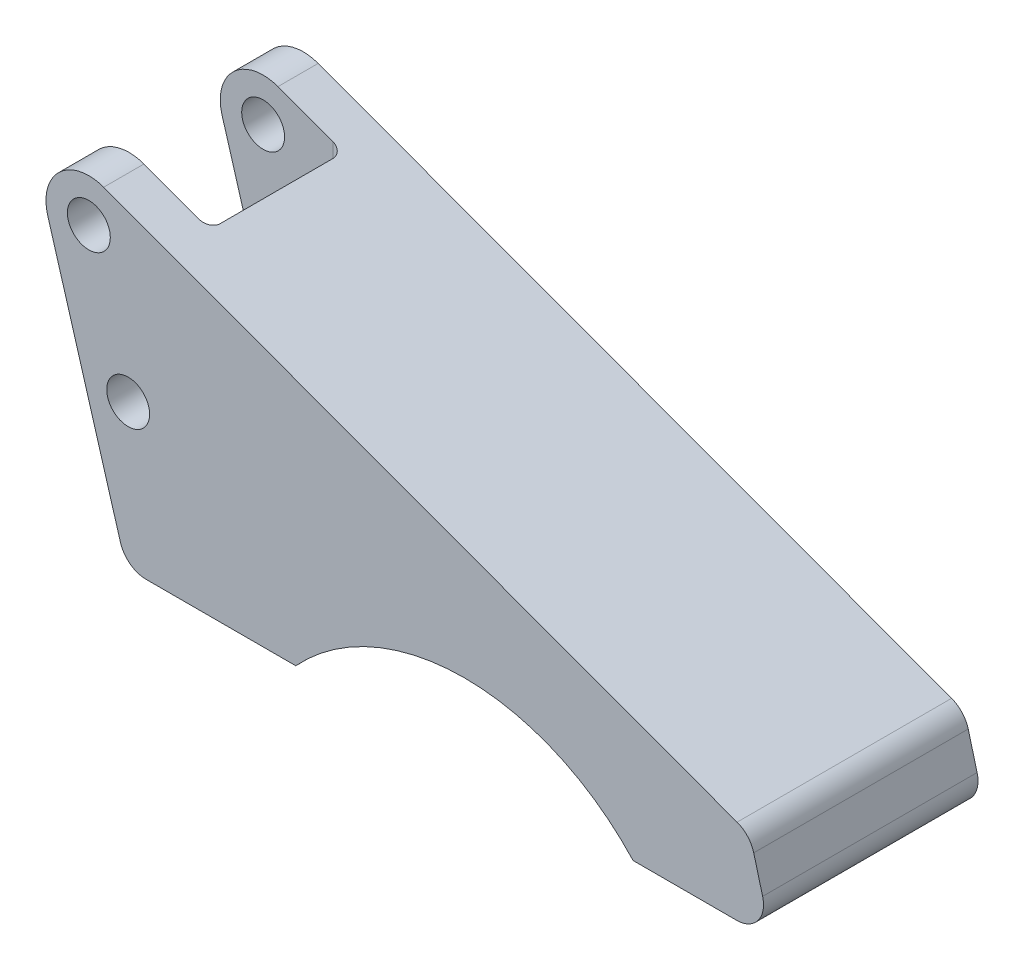
ISO-10303-21;
HEADER;
FILE_DESCRIPTION(('STEP AP214'),'2;1');
FILE_NAME('part.step','',(''),(''),'','','');
FILE_SCHEMA(('AUTOMOTIVE_DESIGN { 1 0 10303 214 1 1 1 1 }'));
ENDSEC;
DATA;
#1=APPLICATION_CONTEXT('core data for automotive mechanical design processes');
#2=APPLICATION_PROTOCOL_DEFINITION('international standard','automotive_design',2000,#1);
#3=PRODUCT_CONTEXT('',#1,'mechanical');
#4=PRODUCT('Part','Part','',(#3));
#5=PRODUCT_RELATED_PRODUCT_CATEGORY('part','',(#4));
#6=PRODUCT_DEFINITION_FORMATION('','',#4);
#7=PRODUCT_DEFINITION_CONTEXT('part definition',#1,'design');
#8=PRODUCT_DEFINITION('design','',#6,#7);
#9=PRODUCT_DEFINITION_SHAPE('','',#8);
#10=(LENGTH_UNIT() NAMED_UNIT(*) SI_UNIT(.MILLI.,.METRE.));
#11=(NAMED_UNIT(*) PLANE_ANGLE_UNIT() SI_UNIT($,.RADIAN.));
#12=(NAMED_UNIT(*) SI_UNIT($,.STERADIAN.) SOLID_ANGLE_UNIT());
#13=UNCERTAINTY_MEASURE_WITH_UNIT(LENGTH_MEASURE(1.E-05),#10,'distance_accuracy_value','');
#14=(GEOMETRIC_REPRESENTATION_CONTEXT(3) GLOBAL_UNCERTAINTY_ASSIGNED_CONTEXT((#13)) GLOBAL_UNIT_ASSIGNED_CONTEXT((#10,
#11,#12)) REPRESENTATION_CONTEXT('',''));
#15=CARTESIAN_POINT('',(0.,0.,0.));
#16=DIRECTION('',(0.,0.,1.));
#17=DIRECTION('',(1.,0.,0.));
#18=AXIS2_PLACEMENT_3D('',#15,#16,#17);
#19=CARTESIAN_POINT('',(6.94754617431199,-51.87,-40.));
#20=DIRECTION('',(-0.959205668272246,-0.282709189723987,0.));
#21=DIRECTION('',(0.282709189723987,-0.959205668272246,0.));
#22=AXIS2_PLACEMENT_3D('',#19,#20,#21);
#23=PLANE('',#22);
#24=DIRECTION('',(0.282709189723987,-0.959205668272246,0.));
#25=VECTOR('',#24,1.);
#26=CARTESIAN_POINT('',(6.94754617431199,-51.87,-32.5));
#27=LINE('',#26,#25);
#28=CARTESIAN_POINT('',(-7.67364534617797,-2.2616735177919,-32.5));
#29=VERTEX_POINT('',#28);
#30=CARTESIAN_POINT('',(5.8905012126467,-48.2835459486199,-32.5));
#31=VERTEX_POINT('',#30);
#32=EDGE_CURVE('E169',#29,#31,#27,.T.);
#33=ORIENTED_EDGE('',*,*,#32,.F.);
#34=DIRECTION('',(0.,0.,1.));
#35=VECTOR('',#34,1.);
#36=CARTESIAN_POINT('',(-7.67364534617797,-2.2616735177919,-40.));
#37=LINE('',#36,#35);
#38=CARTESIAN_POINT('',(-7.67364534617797,-2.2616735177919,-40.));
#39=VERTEX_POINT('',#38);
#40=EDGE_CURVE('E223',#39,#29,#37,.T.);
#41=ORIENTED_EDGE('',*,*,#40,.F.);
#42=DIRECTION('',(0.282709189723987,-0.959205668272246,0.));
#43=VECTOR('',#42,1.);
#44=CARTESIAN_POINT('',(6.94754617431199,-51.87,-40.));
#45=LINE('',#44,#43);
#46=CARTESIAN_POINT('',(5.8905012126467,-48.2835459486199,-40.));
#47=VERTEX_POINT('',#46);
#48=EDGE_CURVE('E238',#39,#47,#45,.T.);
#49=ORIENTED_EDGE('',*,*,#48,.T.);
#50=DIRECTION('',(0.,0.,1.));
#51=VECTOR('',#50,1.);
#52=CARTESIAN_POINT('',(5.8905012126467,-48.2835459486199,-40.));
#53=LINE('',#52,#51);
#54=EDGE_CURVE('E180',#47,#31,#53,.T.);
#55=ORIENTED_EDGE('',*,*,#54,.T.);
#56=EDGE_LOOP('',(#33,#41,#49,#55));
#57=FACE_BOUND('',#56,.T.);
#58=ADVANCED_FACE('F33',(#57),#23,.T.);
#59=CARTESIAN_POINT('',(0.,0.,-40.));
#60=DIRECTION('',(0.,0.,1.));
#61=DIRECTION('',(1.,0.,0.));
#62=AXIS2_PLACEMENT_3D('',#59,#60,#61);
#63=CYLINDRICAL_SURFACE('',#62,8.);
#64=CARTESIAN_POINT('',(0.,0.,-7.5));
#65=DIRECTION('',(0.,0.,1.));
#66=DIRECTION('',(1.,0.,0.));
#67=AXIS2_PLACEMENT_3D('',#64,#65,#66);
#68=CIRCLE('',#67,8.);
#69=CARTESIAN_POINT('',(-7.67364534617797,-2.2616735177919,-7.5));
#70=VERTEX_POINT('',#69);
#71=CARTESIAN_POINT('',(2.76335629071986,7.50758696323518,-7.5));
#72=VERTEX_POINT('',#71);
#73=EDGE_CURVE('E339',#70,#72,#68,.F.);
#74=ORIENTED_EDGE('',*,*,#73,.F.);
#75=CARTESIAN_POINT('',(-7.67364534617797,-2.2616735177919,0.));
#76=VERTEX_POINT('',#75);
#77=EDGE_CURVE('E227',#70,#76,#37,.T.);
#78=ORIENTED_EDGE('',*,*,#77,.T.);
#79=CARTESIAN_POINT('',(0.,0.,0.));
#80=DIRECTION('',(0.,0.,1.));
#81=DIRECTION('',(1.,0.,0.));
#82=AXIS2_PLACEMENT_3D('',#79,#80,#81);
#83=CIRCLE('',#82,8.);
#84=CARTESIAN_POINT('',(2.76335629071986,7.50758696323518,0.));
#85=VERTEX_POINT('',#84);
#86=EDGE_CURVE('E281',#85,#76,#83,.T.);
#87=ORIENTED_EDGE('',*,*,#86,.F.);
#88=DIRECTION('',(0.,0.,1.));
#89=VECTOR('',#88,1.);
#90=CARTESIAN_POINT('',(2.76335629071986,7.50758696323518,-40.));
#91=LINE('',#90,#89);
#92=EDGE_CURVE('E228',#72,#85,#91,.T.);
#93=ORIENTED_EDGE('',*,*,#92,.F.);
#94=EDGE_LOOP('',(#74,#78,#87,#93));
#95=FACE_BOUND('',#94,.T.);
#96=ADVANCED_FACE('F355',(#95),#63,.T.);
#97=CARTESIAN_POINT('',(0.,0.,-40.));
#98=DIRECTION('',(0.,0.,1.));
#99=DIRECTION('',(1.,0.,0.));
#100=AXIS2_PLACEMENT_3D('',#97,#98,#99);
#101=CYLINDRICAL_SURFACE('',#100,4.);
#102=CARTESIAN_POINT('',(0.,0.,-32.5));
#103=DIRECTION('',(0.,0.,-1.));
#104=DIRECTION('',(-1.,0.,0.));
#105=AXIS2_PLACEMENT_3D('',#102,#103,#104);
#106=CIRCLE('',#105,4.);
#107=CARTESIAN_POINT('',(-4.,0.,-32.5));
#108=VERTEX_POINT('',#107);
#109=EDGE_CURVE('E322',#108,#108,#106,.F.);
#110=ORIENTED_EDGE('',*,*,#109,.T.);
#111=EDGE_LOOP('',(#110));
#112=FACE_BOUND('',#111,.T.);
#113=CARTESIAN_POINT('',(0.,0.,-40.));
#114=DIRECTION('',(0.,0.,1.));
#115=DIRECTION('',(1.,0.,0.));
#116=AXIS2_PLACEMENT_3D('',#113,#114,#115);
#117=CIRCLE('',#116,4.);
#118=CARTESIAN_POINT('',(4.,0.,-40.));
#119=VERTEX_POINT('',#118);
#120=EDGE_CURVE('E299',#119,#119,#117,.T.);
#121=ORIENTED_EDGE('',*,*,#120,.F.);
#122=EDGE_LOOP('',(#121));
#123=FACE_BOUND('',#122,.T.);
#124=ADVANCED_FACE('F388',(#112,#123),#101,.F.);
#125=CARTESIAN_POINT('',(7.33,-24.87,-40.));
#126=DIRECTION('',(0.,0.,1.));
#127=DIRECTION('',(1.,0.,0.));
#128=AXIS2_PLACEMENT_3D('',#125,#126,#127);
#129=CYLINDRICAL_SURFACE('',#128,4.);
#130=CARTESIAN_POINT('',(7.33,-24.87,-32.5));
#131=DIRECTION('',(0.,0.,-1.));
#132=DIRECTION('',(-1.,0.,0.));
#133=AXIS2_PLACEMENT_3D('',#130,#131,#132);
#134=CIRCLE('',#133,4.);
#135=CARTESIAN_POINT('',(3.33,-24.87,-32.5));
#136=VERTEX_POINT('',#135);
#137=EDGE_CURVE('E214',#136,#136,#134,.F.);
#138=ORIENTED_EDGE('',*,*,#137,.T.);
#139=EDGE_LOOP('',(#138));
#140=FACE_BOUND('',#139,.T.);
#141=CARTESIAN_POINT('',(7.33,-24.87,-40.));
#142=DIRECTION('',(0.,0.,1.));
#143=DIRECTION('',(1.,0.,0.));
#144=AXIS2_PLACEMENT_3D('',#141,#142,#143);
#145=CIRCLE('',#144,4.);
#146=CARTESIAN_POINT('',(11.33,-24.87,-40.));
#147=VERTEX_POINT('',#146);
#148=EDGE_CURVE('E316',#147,#147,#145,.T.);
#149=ORIENTED_EDGE('',*,*,#148,.F.);
#150=EDGE_LOOP('',(#149));
#151=FACE_BOUND('',#150,.T.);
#152=ADVANCED_FACE('F402',(#140,#151),#129,.F.);
#153=CARTESIAN_POINT('',(10.6865295540079,-46.87,-40.));
#154=DIRECTION('',(0.,0.,1.));
#155=DIRECTION('',(1.,0.,0.));
#156=AXIS2_PLACEMENT_3D('',#153,#154,#155);
#157=CYLINDRICAL_SURFACE('',#156,5.);
#158=CARTESIAN_POINT('',(10.6865295540079,-46.87,-32.5));
#159=DIRECTION('',(0.,0.,-1.));
#160=DIRECTION('',(-1.,0.,0.));
#161=AXIS2_PLACEMENT_3D('',#158,#159,#160);
#162=CIRCLE('',#161,5.);
#163=CARTESIAN_POINT('',(10.6865295540079,-51.87,-32.5));
#164=VERTEX_POINT('',#163);
#165=EDGE_CURVE('E165',#31,#164,#162,.F.);
#166=ORIENTED_EDGE('',*,*,#165,.F.);
#167=ORIENTED_EDGE('',*,*,#54,.F.);
#168=CARTESIAN_POINT('',(10.6865295540079,-46.87,-40.));
#169=DIRECTION('',(0.,0.,1.));
#170=DIRECTION('',(1.,0.,0.));
#171=AXIS2_PLACEMENT_3D('',#168,#169,#170);
#172=CIRCLE('',#171,5.);
#173=CARTESIAN_POINT('',(10.6865295540079,-51.87,-40.));
#174=VERTEX_POINT('',#173);
#175=EDGE_CURVE('E178',#174,#47,#172,.F.);
#176=ORIENTED_EDGE('',*,*,#175,.F.);
#177=DIRECTION('',(0.,0.,1.));
#178=VECTOR('',#177,1.);
#179=CARTESIAN_POINT('',(10.6865295540079,-51.87,-40.));
#180=LINE('',#179,#178);
#181=EDGE_CURVE('E158',#164,#174,#180,.F.);
#182=ORIENTED_EDGE('',*,*,#181,.F.);
#183=EDGE_LOOP('',(#166,#167,#176,#182));
#184=FACE_BOUND('',#183,.T.);
#185=ADVANCED_FACE('F177',(#184),#157,.T.);
#186=CARTESIAN_POINT('',(38.5852070424871,-51.87,-40.));
#187=DIRECTION('',(0.,-1.,0.));
#188=DIRECTION('',(1.,0.,0.));
#189=AXIS2_PLACEMENT_3D('',#186,#187,#188);
#190=PLANE('',#189);
#191=DIRECTION('',(0.,0.,-1.));
#192=VECTOR('',#191,1.);
#193=CARTESIAN_POINT('',(15.,-51.87,-32.5));
#194=LINE('',#193,#192);
#195=CARTESIAN_POINT('',(15.,-51.87,-9.5));
#196=VERTEX_POINT('',#195);
#197=CARTESIAN_POINT('',(15.,-51.87,-30.5));
#198=VERTEX_POINT('',#197);
#199=EDGE_CURVE('E162',#196,#198,#194,.T.);
#200=ORIENTED_EDGE('',*,*,#199,.T.);
#201=CARTESIAN_POINT('',(13.,-51.87,-30.5));
#202=DIRECTION('',(0.,-1.,0.));
#203=DIRECTION('',(1.,0.,0.));
#204=AXIS2_PLACEMENT_3D('',#201,#202,#203);
#205=CIRCLE('',#204,2.);
#206=CARTESIAN_POINT('',(13.,-51.87,-32.5));
#207=VERTEX_POINT('',#206);
#208=EDGE_CURVE('E11',#198,#207,#205,.F.);
#209=ORIENTED_EDGE('',*,*,#208,.T.);
#210=DIRECTION('',(-1.,0.,0.));
#211=VECTOR('',#210,1.);
#212=CARTESIAN_POINT('',(-10.,-51.87,-32.5));
#213=LINE('',#212,#211);
#214=EDGE_CURVE('E154',#207,#164,#213,.T.);
#215=ORIENTED_EDGE('',*,*,#214,.T.);
#216=ORIENTED_EDGE('',*,*,#181,.T.);
#217=DIRECTION('',(1.,0.,0.));
#218=VECTOR('',#217,1.);
#219=CARTESIAN_POINT('',(38.5852070424871,-51.87,-40.));
#220=LINE('',#219,#218);
#221=CARTESIAN_POINT('',(38.5852070424871,-51.87,-40.));
#222=VERTEX_POINT('',#221);
#223=EDGE_CURVE('E282',#174,#222,#220,.T.);
#224=ORIENTED_EDGE('',*,*,#223,.T.);
#225=DIRECTION('',(0.,0.,1.));
#226=VECTOR('',#225,1.);
#227=CARTESIAN_POINT('',(38.5852070424871,-51.87,-40.));
#228=LINE('',#227,#226);
#229=CARTESIAN_POINT('',(38.5852070424871,-51.87,0.));
#230=VERTEX_POINT('',#229);
#231=EDGE_CURVE('E235',#222,#230,#228,.T.);
#232=ORIENTED_EDGE('',*,*,#231,.T.);
#233=DIRECTION('',(1.,0.,0.));
#234=VECTOR('',#233,1.);
#235=CARTESIAN_POINT('',(38.5852070424871,-51.87,0.));
#236=LINE('',#235,#234);
#237=CARTESIAN_POINT('',(10.6865295540079,-51.87,0.));
#238=VERTEX_POINT('',#237);
#239=EDGE_CURVE('E297',#238,#230,#236,.T.);
#240=ORIENTED_EDGE('',*,*,#239,.F.);
#241=CARTESIAN_POINT('',(10.6865295540079,-51.87,-7.5));
#242=VERTEX_POINT('',#241);
#243=EDGE_CURVE('E179',#238,#242,#180,.F.);
#244=ORIENTED_EDGE('',*,*,#243,.T.);
#245=DIRECTION('',(1.,0.,0.));
#246=VECTOR('',#245,1.);
#247=CARTESIAN_POINT('',(-10.,-51.87,-7.5));
#248=LINE('',#247,#246);
#249=CARTESIAN_POINT('',(13.,-51.87,-7.5));
#250=VERTEX_POINT('',#249);
#251=EDGE_CURVE('E343',#242,#250,#248,.T.);
#252=ORIENTED_EDGE('',*,*,#251,.T.);
#253=CARTESIAN_POINT('',(13.,-51.87,-9.5));
#254=DIRECTION('',(0.,-1.,0.));
#255=DIRECTION('',(1.,0.,0.));
#256=AXIS2_PLACEMENT_3D('',#253,#254,#255);
#257=CIRCLE('',#256,2.);
#258=EDGE_CURVE('E201',#250,#196,#257,.F.);
#259=ORIENTED_EDGE('',*,*,#258,.T.);
#260=EDGE_LOOP('',(#200,#209,#215,#216,#224,#232,#240,#244,#252,#259));
#261=FACE_BOUND('',#260,.T.);
#262=ADVANCED_FACE('F156',(#261),#190,.T.);
#263=DIRECTION('',(-0.282709189723987,0.959205668272246,0.));
#264=VECTOR('',#263,1.);
#265=CARTESIAN_POINT('',(6.94754617431199,-51.87,-7.5));
#266=LINE('',#265,#264);
#267=CARTESIAN_POINT('',(5.8905012126467,-48.2835459486199,-7.5));
#268=VERTEX_POINT('',#267);
#269=EDGE_CURVE('E161',#268,#70,#266,.T.);
#270=ORIENTED_EDGE('',*,*,#269,.F.);
#271=CARTESIAN_POINT('',(5.8905012126467,-48.2835459486199,0.));
#272=VERTEX_POINT('',#271);
#273=EDGE_CURVE('E183',#268,#272,#53,.T.);
#274=ORIENTED_EDGE('',*,*,#273,.T.);
#275=DIRECTION('',(0.282709189723987,-0.959205668272246,0.));
#276=VECTOR('',#275,1.);
#277=CARTESIAN_POINT('',(6.94754617431199,-51.87,0.));
#278=LINE('',#277,#276);
#279=EDGE_CURVE('E268',#76,#272,#278,.T.);
#280=ORIENTED_EDGE('',*,*,#279,.F.);
#281=ORIENTED_EDGE('',*,*,#77,.F.);
#282=EDGE_LOOP('',(#270,#274,#280,#281));
#283=FACE_BOUND('',#282,.T.);
#284=ADVANCED_FACE('F265',(#283),#23,.T.);
#285=ORIENTED_EDGE('',*,*,#40,.T.);
#286=CARTESIAN_POINT('',(0.,0.,-32.5));
#287=DIRECTION('',(0.,0.,-1.));
#288=DIRECTION('',(-1.,0.,0.));
#289=AXIS2_PLACEMENT_3D('',#286,#287,#288);
#290=CIRCLE('',#289,8.);
#291=CARTESIAN_POINT('',(2.76335629071986,7.50758696323518,-32.5));
#292=VERTEX_POINT('',#291);
#293=EDGE_CURVE('E213',#292,#29,#290,.F.);
#294=ORIENTED_EDGE('',*,*,#293,.F.);
#295=CARTESIAN_POINT('',(2.76335629071986,7.50758696323518,-40.));
#296=VERTEX_POINT('',#295);
#297=EDGE_CURVE('E221',#296,#292,#91,.T.);
#298=ORIENTED_EDGE('',*,*,#297,.F.);
#299=CARTESIAN_POINT('',(0.,0.,-40.));
#300=DIRECTION('',(0.,0.,1.));
#301=DIRECTION('',(1.,0.,0.));
#302=AXIS2_PLACEMENT_3D('',#299,#300,#301);
#303=CIRCLE('',#302,8.);
#304=EDGE_CURVE('E302',#296,#39,#303,.T.);
#305=ORIENTED_EDGE('',*,*,#304,.T.);
#306=EDGE_LOOP('',(#285,#294,#298,#305));
#307=FACE_BOUND('',#306,.T.);
#308=ADVANCED_FACE('F219',(#307),#63,.T.);
#309=CARTESIAN_POINT('',(123.33,-36.87,-40.));
#310=DIRECTION('',(0.345419536339983,0.938448370404398,0.));
#311=DIRECTION('',(-0.938448370404398,0.345419536339983,0.));
#312=AXIS2_PLACEMENT_3D('',#309,#310,#311);
#313=PLANE('',#312);
#314=DIRECTION('',(-0.938448370404398,0.345419536339983,0.));
#315=VECTOR('',#314,1.);
#316=CARTESIAN_POINT('',(123.33,-36.87,-32.5));
#317=LINE('',#316,#315);
#318=CARTESIAN_POINT('',(13.,3.73973266751784,-32.5));
#319=VERTEX_POINT('',#318);
#320=EDGE_CURVE('E207',#319,#292,#317,.T.);
#321=ORIENTED_EDGE('',*,*,#320,.F.);
#322=CARTESIAN_POINT('',(13.,3.73973266751784,-30.5));
#323=DIRECTION('',(0.345419536339983,0.938448370404398,0.));
#324=DIRECTION('',(0.938448370404398,-0.345419536339983,0.));
#325=AXIS2_PLACEMENT_3D('',#322,#323,#324);
#326=ELLIPSE('',#325,2.13117744467728,2.);
#327=CARTESIAN_POINT('',(15.,3.00358234271918,-30.5));
#328=VERTEX_POINT('',#327);
#329=EDGE_CURVE('E41',#319,#328,#326,.F.);
#330=ORIENTED_EDGE('',*,*,#329,.T.);
#331=DIRECTION('',(0.,0.,-1.));
#332=VECTOR('',#331,1.);
#333=CARTESIAN_POINT('',(15.,3.00358234271918,-40.));
#334=LINE('',#333,#332);
#335=CARTESIAN_POINT('',(15.,3.00358234271918,-9.5));
#336=VERTEX_POINT('',#335);
#337=EDGE_CURVE('E173',#336,#328,#334,.T.);
#338=ORIENTED_EDGE('',*,*,#337,.F.);
#339=CARTESIAN_POINT('',(13.,3.73973266751784,-9.5));
#340=DIRECTION('',(0.345419536339983,0.938448370404398,0.));
#341=DIRECTION('',(0.938448370404398,-0.345419536339983,0.));
#342=AXIS2_PLACEMENT_3D('',#339,#340,#341);
#343=ELLIPSE('',#342,2.13117744467728,2.);
#344=CARTESIAN_POINT('',(13.,3.73973266751784,-7.5));
#345=VERTEX_POINT('',#344);
#346=EDGE_CURVE('E199',#336,#345,#343,.F.);
#347=ORIENTED_EDGE('',*,*,#346,.T.);
#348=DIRECTION('',(0.938448370404398,-0.345419536339983,0.));
#349=VECTOR('',#348,1.);
#350=CARTESIAN_POINT('',(123.33,-36.87,-7.5));
#351=LINE('',#350,#349);
#352=EDGE_CURVE('E336',#72,#345,#351,.T.);
#353=ORIENTED_EDGE('',*,*,#352,.F.);
#354=ORIENTED_EDGE('',*,*,#92,.T.);
#355=DIRECTION('',(-0.938448370404398,0.345419536339983,0.));
#356=VECTOR('',#355,1.);
#357=CARTESIAN_POINT('',(123.33,-36.87,0.));
#358=LINE('',#357,#356);
#359=CARTESIAN_POINT('',(120.894593949471,-35.9735875224431,0.));
#360=VERTEX_POINT('',#359);
#361=EDGE_CURVE('E285',#360,#85,#358,.T.);
#362=ORIENTED_EDGE('',*,*,#361,.F.);
#363=DIRECTION('',(0.,0.,1.));
#364=VECTOR('',#363,1.);
#365=CARTESIAN_POINT('',(120.894593949471,-35.9735875224431,-40.));
#366=LINE('',#365,#364);
#367=CARTESIAN_POINT('',(120.894593949471,-35.9735875224431,-40.));
#368=VERTEX_POINT('',#367);
#369=EDGE_CURVE('E257',#360,#368,#366,.F.);
#370=ORIENTED_EDGE('',*,*,#369,.T.);
#371=DIRECTION('',(-0.938448370404398,0.345419536339983,0.));
#372=VECTOR('',#371,1.);
#373=CARTESIAN_POINT('',(123.33,-36.87,-40.));
#374=LINE('',#373,#372);
#375=EDGE_CURVE('E226',#368,#296,#374,.T.);
#376=ORIENTED_EDGE('',*,*,#375,.T.);
#377=ORIENTED_EDGE('',*,*,#297,.T.);
#378=EDGE_LOOP('',(#321,#330,#338,#347,#353,#354,#362,#370,#376,#377));
#379=FACE_BOUND('',#378,.T.);
#380=ADVANCED_FACE('F205',(#379),#313,.T.);
#381=CARTESIAN_POINT('',(127.33,-51.87,-40.));
#382=DIRECTION('',(0.966234939601247,0.257662650560332,0.));
#383=DIRECTION('',(-0.257662650560332,0.966234939601247,0.));
#384=AXIS2_PLACEMENT_3D('',#381,#382,#383);
#385=PLANE('',#384);
#386=DIRECTION('',(-0.257662650560332,0.966234939601246,0.));
#387=VECTOR('',#386,1.);
#388=CARTESIAN_POINT('',(127.33,-51.87,0.));
#389=LINE('',#388,#387);
#390=CARTESIAN_POINT('',(125.65311646592,-45.5816867471983,0.));
#391=VERTEX_POINT('',#390);
#392=CARTESIAN_POINT('',(123.998670965777,-39.3775161216634,0.));
#393=VERTEX_POINT('',#392);
#394=EDGE_CURVE('E289',#391,#393,#389,.T.);
#395=ORIENTED_EDGE('',*,*,#394,.F.);
#396=DIRECTION('',(0.,0.,1.));
#397=VECTOR('',#396,1.);
#398=CARTESIAN_POINT('',(125.65311646592,-45.5816867471983,-40.));
#399=LINE('',#398,#397);
#400=CARTESIAN_POINT('',(125.65311646592,-45.5816867471983,-40.));
#401=VERTEX_POINT('',#400);
#402=EDGE_CURVE('E251',#391,#401,#399,.F.);
#403=ORIENTED_EDGE('',*,*,#402,.T.);
#404=DIRECTION('',(-0.257662650560332,0.966234939601246,0.));
#405=VECTOR('',#404,1.);
#406=CARTESIAN_POINT('',(127.33,-51.87,-40.));
#407=LINE('',#406,#405);
#408=CARTESIAN_POINT('',(123.998670965777,-39.3775161216634,-40.));
#409=VERTEX_POINT('',#408);
#410=EDGE_CURVE('E305',#401,#409,#407,.T.);
#411=ORIENTED_EDGE('',*,*,#410,.T.);
#412=DIRECTION('',(0.,0.,1.));
#413=VECTOR('',#412,1.);
#414=CARTESIAN_POINT('',(123.998670965777,-39.3775161216634,-40.));
#415=LINE('',#414,#413);
#416=EDGE_CURVE('E248',#409,#393,#415,.T.);
#417=ORIENTED_EDGE('',*,*,#416,.T.);
#418=EDGE_LOOP('',(#395,#403,#411,#417));
#419=FACE_BOUND('',#418,.T.);
#420=ADVANCED_FACE('F362',(#419),#385,.T.);
#421=CARTESIAN_POINT('',(101.494792957513,-51.87,-40.));
#422=DIRECTION('',(0.,-1.,0.));
#423=DIRECTION('',(1.,0.,0.));
#424=AXIS2_PLACEMENT_3D('',#421,#422,#423);
#425=PLANE('',#424);
#426=DIRECTION('',(1.,0.,0.));
#427=VECTOR('',#426,1.);
#428=CARTESIAN_POINT('',(101.494792957513,-51.87,-40.));
#429=LINE('',#428,#427);
#430=CARTESIAN_POINT('',(101.494792957513,-51.87,-40.));
#431=VERTEX_POINT('',#430);
#432=CARTESIAN_POINT('',(120.821941767913,-51.87,-40.));
#433=VERTEX_POINT('',#432);
#434=EDGE_CURVE('E308',#431,#433,#429,.T.);
#435=ORIENTED_EDGE('',*,*,#434,.T.);
#436=DIRECTION('',(0.,0.,1.));
#437=VECTOR('',#436,1.);
#438=CARTESIAN_POINT('',(120.821941767913,-51.87,-40.));
#439=LINE('',#438,#437);
#440=CARTESIAN_POINT('',(120.821941767913,-51.87,0.));
#441=VERTEX_POINT('',#440);
#442=EDGE_CURVE('E239',#433,#441,#439,.T.);
#443=ORIENTED_EDGE('',*,*,#442,.T.);
#444=DIRECTION('',(1.,0.,0.));
#445=VECTOR('',#444,1.);
#446=CARTESIAN_POINT('',(101.494792957513,-51.87,0.));
#447=LINE('',#446,#445);
#448=CARTESIAN_POINT('',(101.494792957513,-51.87,0.));
#449=VERTEX_POINT('',#448);
#450=EDGE_CURVE('E292',#449,#441,#447,.T.);
#451=ORIENTED_EDGE('',*,*,#450,.F.);
#452=DIRECTION('',(0.,0.,1.));
#453=VECTOR('',#452,1.);
#454=CARTESIAN_POINT('',(101.494792957513,-51.87,-40.));
#455=LINE('',#454,#453);
#456=EDGE_CURVE('E231',#431,#449,#455,.T.);
#457=ORIENTED_EDGE('',*,*,#456,.F.);
#458=EDGE_LOOP('',(#435,#443,#451,#457));
#459=FACE_BOUND('',#458,.T.);
#460=ADVANCED_FACE('F374',(#459),#425,.T.);
#461=CARTESIAN_POINT('',(70.04,-80.88,-40.));
#462=DIRECTION('',(0.,0.,1.));
#463=DIRECTION('',(1.,0.,0.));
#464=AXIS2_PLACEMENT_3D('',#461,#462,#463);
#465=CYLINDRICAL_SURFACE('',#464,42.79);
#466=CARTESIAN_POINT('',(70.04,-80.88,0.));
#467=DIRECTION('',(0.,0.,-1.));
#468=DIRECTION('',(1.,0.,0.));
#469=AXIS2_PLACEMENT_3D('',#466,#467,#468);
#470=CIRCLE('',#469,42.79);
#471=EDGE_CURVE('E294',#230,#449,#470,.T.);
#472=ORIENTED_EDGE('',*,*,#471,.F.);
#473=ORIENTED_EDGE('',*,*,#231,.F.);
#474=CARTESIAN_POINT('',(70.04,-80.88,-40.));
#475=DIRECTION('',(0.,0.,-1.));
#476=DIRECTION('',(1.,0.,0.));
#477=AXIS2_PLACEMENT_3D('',#474,#475,#476);
#478=CIRCLE('',#477,42.79);
#479=EDGE_CURVE('E283',#222,#431,#478,.T.);
#480=ORIENTED_EDGE('',*,*,#479,.T.);
#481=ORIENTED_EDGE('',*,*,#456,.T.);
#482=EDGE_LOOP('',(#472,#473,#480,#481));
#483=FACE_BOUND('',#482,.T.);
#484=ADVANCED_FACE('F378',(#483),#465,.F.);
#485=CARTESIAN_POINT('',(0.,0.,-40.));
#486=DIRECTION('',(0.,0.,1.));
#487=DIRECTION('',(1.,0.,0.));
#488=AXIS2_PLACEMENT_3D('',#485,#486,#487);
#489=PLANE('',#488);
#490=ORIENTED_EDGE('',*,*,#148,.T.);
#491=EDGE_LOOP('',(#490));
#492=FACE_BOUND('',#491,.T.);
#493=ORIENTED_EDGE('',*,*,#120,.T.);
#494=EDGE_LOOP('',(#493));
#495=FACE_BOUND('',#494,.T.);
#496=ORIENTED_EDGE('',*,*,#410,.F.);
#497=CARTESIAN_POINT('',(120.821941767913,-46.87,-40.));
#498=DIRECTION('',(0.,0.,1.));
#499=DIRECTION('',(1.,0.,0.));
#500=AXIS2_PLACEMENT_3D('',#497,#498,#499);
#501=CIRCLE('',#500,5.);
#502=EDGE_CURVE('E256',#401,#433,#501,.F.);
#503=ORIENTED_EDGE('',*,*,#502,.T.);
#504=ORIENTED_EDGE('',*,*,#434,.F.);
#505=ORIENTED_EDGE('',*,*,#479,.F.);
#506=ORIENTED_EDGE('',*,*,#223,.F.);
#507=ORIENTED_EDGE('',*,*,#175,.T.);
#508=ORIENTED_EDGE('',*,*,#48,.F.);
#509=ORIENTED_EDGE('',*,*,#304,.F.);
#510=ORIENTED_EDGE('',*,*,#375,.F.);
#511=CARTESIAN_POINT('',(119.167496267771,-40.6658293744651,-40.));
#512=DIRECTION('',(0.,0.,1.));
#513=DIRECTION('',(1.,0.,0.));
#514=AXIS2_PLACEMENT_3D('',#511,#512,#513);
#515=CIRCLE('',#514,5.);
#516=EDGE_CURVE('E254',#368,#409,#515,.F.);
#517=ORIENTED_EDGE('',*,*,#516,.T.);
#518=EDGE_LOOP('',(#496,#503,#504,#505,#506,#507,#508,#509,#510,#517));
#519=FACE_BOUND('',#518,.T.);
#520=ADVANCED_FACE('F367',(#492,#495,#519),#489,.F.);
#521=CARTESIAN_POINT('',(0.,0.,0.));
#522=DIRECTION('',(0.,0.,1.));
#523=DIRECTION('',(1.,0.,0.));
#524=AXIS2_PLACEMENT_3D('',#521,#522,#523);
#525=PLANE('',#524);
#526=CARTESIAN_POINT('',(7.33,-24.87,0.));
#527=DIRECTION('',(0.,0.,1.));
#528=DIRECTION('',(1.,0.,0.));
#529=AXIS2_PLACEMENT_3D('',#526,#527,#528);
#530=CIRCLE('',#529,4.);
#531=CARTESIAN_POINT('',(11.33,-24.87,0.));
#532=VERTEX_POINT('',#531);
#533=EDGE_CURVE('E319',#532,#532,#530,.T.);
#534=ORIENTED_EDGE('',*,*,#533,.F.);
#535=EDGE_LOOP('',(#534));
#536=FACE_BOUND('',#535,.T.);
#537=CARTESIAN_POINT('',(0.,0.,0.));
#538=DIRECTION('',(0.,0.,1.));
#539=DIRECTION('',(1.,0.,0.));
#540=AXIS2_PLACEMENT_3D('',#537,#538,#539);
#541=CIRCLE('',#540,4.);
#542=CARTESIAN_POINT('',(4.,0.,0.));
#543=VERTEX_POINT('',#542);
#544=EDGE_CURVE('E313',#543,#543,#541,.T.);
#545=ORIENTED_EDGE('',*,*,#544,.F.);
#546=EDGE_LOOP('',(#545));
#547=FACE_BOUND('',#546,.T.);
#548=ORIENTED_EDGE('',*,*,#450,.T.);
#549=CARTESIAN_POINT('',(120.821941767913,-46.87,0.));
#550=DIRECTION('',(0.,0.,1.));
#551=DIRECTION('',(1.,0.,0.));
#552=AXIS2_PLACEMENT_3D('',#549,#550,#551);
#553=CIRCLE('',#552,5.);
#554=EDGE_CURVE('E246',#441,#391,#553,.T.);
#555=ORIENTED_EDGE('',*,*,#554,.T.);
#556=ORIENTED_EDGE('',*,*,#394,.T.);
#557=CARTESIAN_POINT('',(119.167496267771,-40.6658293744651,0.));
#558=DIRECTION('',(0.,0.,1.));
#559=DIRECTION('',(1.,0.,0.));
#560=AXIS2_PLACEMENT_3D('',#557,#558,#559);
#561=CIRCLE('',#560,5.);
#562=EDGE_CURVE('E244',#393,#360,#561,.T.);
#563=ORIENTED_EDGE('',*,*,#562,.T.);
#564=ORIENTED_EDGE('',*,*,#361,.T.);
#565=ORIENTED_EDGE('',*,*,#86,.T.);
#566=ORIENTED_EDGE('',*,*,#279,.T.);
#567=CARTESIAN_POINT('',(10.6865295540079,-46.87,0.));
#568=DIRECTION('',(0.,0.,1.));
#569=DIRECTION('',(1.,0.,0.));
#570=AXIS2_PLACEMENT_3D('',#567,#568,#569);
#571=CIRCLE('',#570,5.);
#572=EDGE_CURVE('E242',#272,#238,#571,.T.);
#573=ORIENTED_EDGE('',*,*,#572,.T.);
#574=ORIENTED_EDGE('',*,*,#239,.T.);
#575=ORIENTED_EDGE('',*,*,#471,.T.);
#576=EDGE_LOOP('',(#548,#555,#556,#563,#564,#565,#566,#573,#574,#575));
#577=FACE_BOUND('',#576,.T.);
#578=ADVANCED_FACE('F278',(#536,#547,#577),#525,.T.);
#579=CARTESIAN_POINT('',(0.,0.,-7.5));
#580=DIRECTION('',(0.,0.,1.));
#581=DIRECTION('',(1.,0.,0.));
#582=AXIS2_PLACEMENT_3D('',#579,#580,#581);
#583=CIRCLE('',#582,4.);
#584=CARTESIAN_POINT('',(4.,0.,-7.5));
#585=VERTEX_POINT('',#584);
#586=EDGE_CURVE('E330',#585,#585,#583,.F.);
#587=ORIENTED_EDGE('',*,*,#586,.T.);
#588=EDGE_LOOP('',(#587));
#589=FACE_BOUND('',#588,.T.);
#590=ORIENTED_EDGE('',*,*,#544,.T.);
#591=EDGE_LOOP('',(#590));
#592=FACE_BOUND('',#591,.T.);
#593=ADVANCED_FACE('F426',(#589,#592),#101,.F.);
#594=CARTESIAN_POINT('',(7.33,-24.87,-7.5));
#595=DIRECTION('',(0.,0.,1.));
#596=DIRECTION('',(1.,0.,0.));
#597=AXIS2_PLACEMENT_3D('',#594,#595,#596);
#598=CIRCLE('',#597,4.);
#599=CARTESIAN_POINT('',(11.33,-24.87,-7.5));
#600=VERTEX_POINT('',#599);
#601=EDGE_CURVE('E333',#600,#600,#598,.F.);
#602=ORIENTED_EDGE('',*,*,#601,.T.);
#603=EDGE_LOOP('',(#602));
#604=FACE_BOUND('',#603,.T.);
#605=ORIENTED_EDGE('',*,*,#533,.T.);
#606=EDGE_LOOP('',(#605));
#607=FACE_BOUND('',#606,.T.);
#608=ADVANCED_FACE('F409',(#604,#607),#129,.F.);
#609=CARTESIAN_POINT('',(120.821941767913,-46.87,-40.));
#610=DIRECTION('',(0.,0.,1.));
#611=DIRECTION('',(1.,0.,0.));
#612=AXIS2_PLACEMENT_3D('',#609,#610,#611);
#613=CYLINDRICAL_SURFACE('',#612,5.);
#614=ORIENTED_EDGE('',*,*,#502,.F.);
#615=ORIENTED_EDGE('',*,*,#402,.F.);
#616=ORIENTED_EDGE('',*,*,#554,.F.);
#617=ORIENTED_EDGE('',*,*,#442,.F.);
#618=EDGE_LOOP('',(#614,#615,#616,#617));
#619=FACE_BOUND('',#618,.T.);
#620=ADVANCED_FACE('F371',(#619),#613,.T.);
#621=CARTESIAN_POINT('',(119.167496267771,-40.6658293744651,-40.));
#622=DIRECTION('',(0.,0.,1.));
#623=DIRECTION('',(1.,0.,0.));
#624=AXIS2_PLACEMENT_3D('',#621,#622,#623);
#625=CYLINDRICAL_SURFACE('',#624,5.);
#626=ORIENTED_EDGE('',*,*,#516,.F.);
#627=ORIENTED_EDGE('',*,*,#369,.F.);
#628=ORIENTED_EDGE('',*,*,#562,.F.);
#629=ORIENTED_EDGE('',*,*,#416,.F.);
#630=EDGE_LOOP('',(#626,#627,#628,#629));
#631=FACE_BOUND('',#630,.T.);
#632=ADVANCED_FACE('F360',(#631),#625,.T.);
#633=CARTESIAN_POINT('',(10.6865295540079,-46.87,-7.5));
#634=DIRECTION('',(0.,0.,1.));
#635=DIRECTION('',(1.,0.,0.));
#636=AXIS2_PLACEMENT_3D('',#633,#634,#635);
#637=CIRCLE('',#636,5.);
#638=EDGE_CURVE('E174',#242,#268,#637,.F.);
#639=ORIENTED_EDGE('',*,*,#638,.F.);
#640=ORIENTED_EDGE('',*,*,#243,.F.);
#641=ORIENTED_EDGE('',*,*,#572,.F.);
#642=ORIENTED_EDGE('',*,*,#273,.F.);
#643=EDGE_LOOP('',(#639,#640,#641,#642));
#644=FACE_BOUND('',#643,.T.);
#645=ADVANCED_FACE('F273',(#644),#157,.T.);
#646=CARTESIAN_POINT('',(-10.,-51.87,-32.5));
#647=DIRECTION('',(0.,0.,-1.));
#648=DIRECTION('',(-1.,0.,0.));
#649=AXIS2_PLACEMENT_3D('',#646,#647,#648);
#650=PLANE('',#649);
#651=ORIENTED_EDGE('',*,*,#137,.F.);
#652=EDGE_LOOP('',(#651));
#653=FACE_BOUND('',#652,.T.);
#654=ORIENTED_EDGE('',*,*,#214,.F.);
#655=DIRECTION('',(0.,1.,0.));
#656=VECTOR('',#655,1.);
#657=CARTESIAN_POINT('',(13.,3.00358234271918,-32.5));
#658=LINE('',#657,#656);
#659=EDGE_CURVE('E197',#207,#319,#658,.T.);
#660=ORIENTED_EDGE('',*,*,#659,.T.);
#661=ORIENTED_EDGE('',*,*,#320,.T.);
#662=ORIENTED_EDGE('',*,*,#293,.T.);
#663=ORIENTED_EDGE('',*,*,#32,.T.);
#664=ORIENTED_EDGE('',*,*,#165,.T.);
#665=EDGE_LOOP('',(#654,#660,#661,#662,#663,#664));
#666=FACE_BOUND('',#665,.T.);
#667=ORIENTED_EDGE('',*,*,#109,.F.);
#668=EDGE_LOOP('',(#667));
#669=FACE_BOUND('',#668,.T.);
#670=ADVANCED_FACE('F166',(#653,#666,#669),#650,.F.);
#671=CARTESIAN_POINT('',(-10.,-51.87,-7.5));
#672=DIRECTION('',(0.,0.,1.));
#673=DIRECTION('',(1.,0.,0.));
#674=AXIS2_PLACEMENT_3D('',#671,#672,#673);
#675=PLANE('',#674);
#676=ORIENTED_EDGE('',*,*,#601,.F.);
#677=EDGE_LOOP('',(#676));
#678=FACE_BOUND('',#677,.T.);
#679=ORIENTED_EDGE('',*,*,#352,.T.);
#680=DIRECTION('',(0.,1.,0.));
#681=VECTOR('',#680,1.);
#682=CARTESIAN_POINT('',(13.,-51.87,-7.5));
#683=LINE('',#682,#681);
#684=EDGE_CURVE('E195',#345,#250,#683,.F.);
#685=ORIENTED_EDGE('',*,*,#684,.T.);
#686=ORIENTED_EDGE('',*,*,#251,.F.);
#687=ORIENTED_EDGE('',*,*,#638,.T.);
#688=ORIENTED_EDGE('',*,*,#269,.T.);
#689=ORIENTED_EDGE('',*,*,#73,.T.);
#690=EDGE_LOOP('',(#679,#685,#686,#687,#688,#689));
#691=FACE_BOUND('',#690,.T.);
#692=ORIENTED_EDGE('',*,*,#586,.F.);
#693=EDGE_LOOP('',(#692));
#694=FACE_BOUND('',#693,.T.);
#695=ADVANCED_FACE('F352',(#678,#691,#694),#675,.F.);
#696=CARTESIAN_POINT('',(15.,-51.87,-32.5));
#697=DIRECTION('',(1.,0.,0.));
#698=DIRECTION('',(0.,0.,-1.));
#699=AXIS2_PLACEMENT_3D('',#696,#697,#698);
#700=PLANE('',#699);
#701=ORIENTED_EDGE('',*,*,#199,.F.);
#702=DIRECTION('',(0.,1.,0.));
#703=VECTOR('',#702,1.);
#704=CARTESIAN_POINT('',(15.,3.00358234271918,-9.5));
#705=LINE('',#704,#703);
#706=EDGE_CURVE('E192',#196,#336,#705,.T.);
#707=ORIENTED_EDGE('',*,*,#706,.T.);
#708=ORIENTED_EDGE('',*,*,#337,.T.);
#709=DIRECTION('',(0.,1.,0.));
#710=VECTOR('',#709,1.);
#711=CARTESIAN_POINT('',(15.,-51.87,-30.5));
#712=LINE('',#711,#710);
#713=EDGE_CURVE('E190',#328,#198,#712,.F.);
#714=ORIENTED_EDGE('',*,*,#713,.T.);
#715=EDGE_LOOP('',(#701,#707,#708,#714));
#716=FACE_BOUND('',#715,.T.);
#717=ADVANCED_FACE('F210',(#716),#700,.F.);
#718=CARTESIAN_POINT('',(13.,-51.87,-9.5));
#719=DIRECTION('',(0.,-1.,0.));
#720=DIRECTION('',(0.,0.,-1.));
#721=AXIS2_PLACEMENT_3D('',#718,#719,#720);
#722=CYLINDRICAL_SURFACE('',#721,2.);
#723=ORIENTED_EDGE('',*,*,#258,.F.);
#724=ORIENTED_EDGE('',*,*,#684,.F.);
#725=ORIENTED_EDGE('',*,*,#346,.F.);
#726=ORIENTED_EDGE('',*,*,#706,.F.);
#727=EDGE_LOOP('',(#723,#724,#725,#726));
#728=FACE_BOUND('',#727,.T.);
#729=ADVANCED_FACE('F349',(#728),#722,.F.);
#730=CARTESIAN_POINT('',(13.,-51.87,-30.5));
#731=DIRECTION('',(0.,-1.,0.));
#732=DIRECTION('',(0.,0.,-1.));
#733=AXIS2_PLACEMENT_3D('',#730,#731,#732);
#734=CYLINDRICAL_SURFACE('',#733,2.);
#735=ORIENTED_EDGE('',*,*,#208,.F.);
#736=ORIENTED_EDGE('',*,*,#713,.F.);
#737=ORIENTED_EDGE('',*,*,#329,.F.);
#738=ORIENTED_EDGE('',*,*,#659,.F.);
#739=EDGE_LOOP('',(#735,#736,#737,#738));
#740=FACE_BOUND('',#739,.T.);
#741=ADVANCED_FACE('F35',(#740),#734,.F.);
#742=CLOSED_SHELL('',(#58,#96,#124,#152,#185,#262,#284,#308,#380,#420,#460,#484,#520,#578,#593,
#608,#620,#632,#645,#670,#695,#717,#729,#741));
#743=MANIFOLD_SOLID_BREP('B2',#742);
#744=ADVANCED_BREP_SHAPE_REPRESENTATION('',(#18,#743),#14);
#745=SHAPE_DEFINITION_REPRESENTATION(#9,#744);
ENDSEC;
END-ISO-10303-21;
